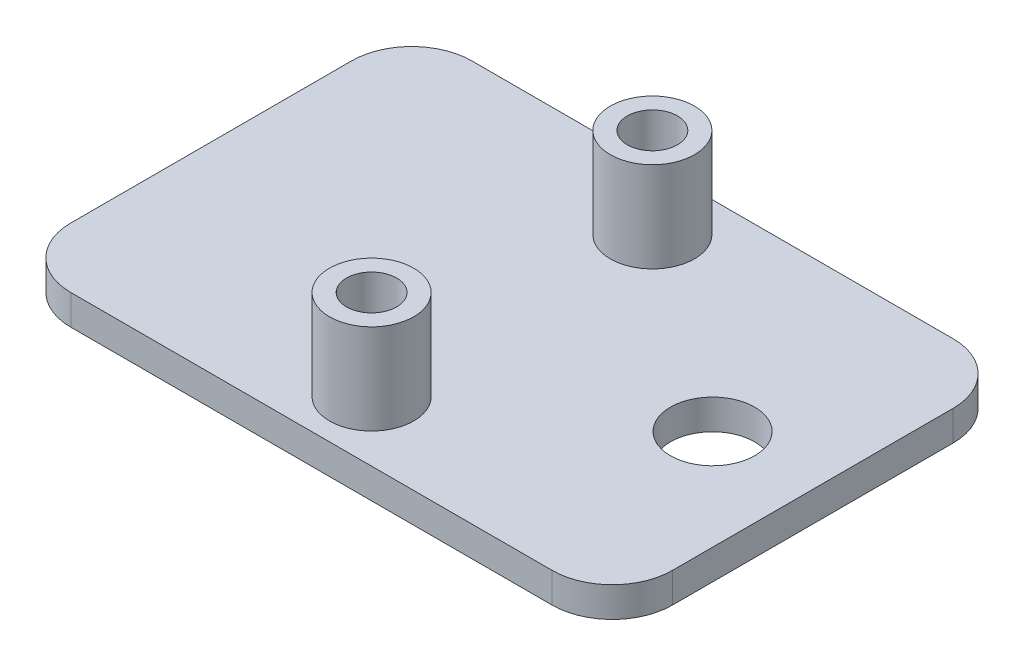
ISO-10303-21;
HEADER;
FILE_DESCRIPTION(('STEP AP214'),'2;1');
FILE_NAME('part.step','',(''),(''),'','','');
FILE_SCHEMA(('AUTOMOTIVE_DESIGN { 1 0 10303 214 1 1 1 1 }'));
ENDSEC;
DATA;
#1=APPLICATION_CONTEXT('core data for automotive mechanical design processes');
#2=APPLICATION_PROTOCOL_DEFINITION('international standard','automotive_design',2000,#1);
#3=PRODUCT_CONTEXT('',#1,'mechanical');
#4=PRODUCT('Part','Part','',(#3));
#5=PRODUCT_RELATED_PRODUCT_CATEGORY('part','',(#4));
#6=PRODUCT_DEFINITION_FORMATION('','',#4);
#7=PRODUCT_DEFINITION_CONTEXT('part definition',#1,'design');
#8=PRODUCT_DEFINITION('design','',#6,#7);
#9=PRODUCT_DEFINITION_SHAPE('','',#8);
#10=(LENGTH_UNIT() NAMED_UNIT(*) SI_UNIT(.MILLI.,.METRE.));
#11=(NAMED_UNIT(*) PLANE_ANGLE_UNIT() SI_UNIT($,.RADIAN.));
#12=(NAMED_UNIT(*) SI_UNIT($,.STERADIAN.) SOLID_ANGLE_UNIT());
#13=UNCERTAINTY_MEASURE_WITH_UNIT(LENGTH_MEASURE(1.E-05),#10,'distance_accuracy_value','');
#14=(GEOMETRIC_REPRESENTATION_CONTEXT(3) GLOBAL_UNCERTAINTY_ASSIGNED_CONTEXT((#13)) GLOBAL_UNIT_ASSIGNED_CONTEXT((#10,
#11,#12)) REPRESENTATION_CONTEXT('',''));
#15=CARTESIAN_POINT('',(0.,0.,0.));
#16=DIRECTION('',(0.,0.,1.));
#17=DIRECTION('',(1.,0.,0.));
#18=AXIS2_PLACEMENT_3D('',#15,#16,#17);
#19=CARTESIAN_POINT('',(-7.384325117692,-1.5,-7.));
#20=DIRECTION('',(0.,1.,0.));
#21=DIRECTION('',(0.,0.,1.));
#22=AXIS2_PLACEMENT_3D('',#19,#20,#21);
#23=CYLINDRICAL_SURFACE('',#22,3.);
#24=CARTESIAN_POINT('',(-7.384325117692,0.,-7.));
#25=DIRECTION('',(0.,1.,0.));
#26=DIRECTION('',(0.,0.,1.));
#27=AXIS2_PLACEMENT_3D('',#24,#25,#26);
#28=CIRCLE('',#27,3.);
#29=CARTESIAN_POINT('',(-7.38432511769198,0.,-10.));
#30=VERTEX_POINT('',#29);
#31=CARTESIAN_POINT('',(-10.384325117692,0.,-6.99999999999998));
#32=VERTEX_POINT('',#31);
#33=EDGE_CURVE('E137',#30,#32,#28,.T.);
#34=ORIENTED_EDGE('',*,*,#33,.F.);
#35=DIRECTION('',(0.,1.,0.));
#36=VECTOR('',#35,1.);
#37=CARTESIAN_POINT('',(-7.38432511769198,-1.5,-10.));
#38=LINE('',#37,#36);
#39=CARTESIAN_POINT('',(-7.38432511769198,-1.5,-10.));
#40=VERTEX_POINT('',#39);
#41=EDGE_CURVE('E11',#40,#30,#38,.T.);
#42=ORIENTED_EDGE('',*,*,#41,.F.);
#43=CARTESIAN_POINT('',(-7.384325117692,-1.5,-7.));
#44=DIRECTION('',(0.,1.,0.));
#45=DIRECTION('',(0.,0.,1.));
#46=AXIS2_PLACEMENT_3D('',#43,#44,#45);
#47=CIRCLE('',#46,3.);
#48=CARTESIAN_POINT('',(-10.384325117692,-1.5,-6.99999999999998));
#49=VERTEX_POINT('',#48);
#50=EDGE_CURVE('E158',#40,#49,#47,.T.);
#51=ORIENTED_EDGE('',*,*,#50,.T.);
#52=DIRECTION('',(0.,1.,0.));
#53=VECTOR('',#52,1.);
#54=CARTESIAN_POINT('',(-10.384325117692,-1.5,-6.99999999999998));
#55=LINE('',#54,#53);
#56=EDGE_CURVE('E43',#49,#32,#55,.T.);
#57=ORIENTED_EDGE('',*,*,#56,.T.);
#58=EDGE_LOOP('',(#34,#42,#51,#57));
#59=FACE_BOUND('',#58,.T.);
#60=ADVANCED_FACE('F40',(#59),#23,.T.);
#61=CARTESIAN_POINT('',(-7.38432511769198,-1.5,-10.));
#62=DIRECTION('',(0.,0.,-1.));
#63=DIRECTION('',(-1.,0.,0.));
#64=AXIS2_PLACEMENT_3D('',#61,#62,#63);
#65=PLANE('',#64);
#66=DIRECTION('',(-1.,0.,0.));
#67=VECTOR('',#66,1.);
#68=CARTESIAN_POINT('',(-7.38432511769198,0.,-10.));
#69=LINE('',#68,#67);
#70=CARTESIAN_POINT('',(16.615674882308,0.,-10.));
#71=VERTEX_POINT('',#70);
#72=EDGE_CURVE('E156',#71,#30,#69,.T.);
#73=ORIENTED_EDGE('',*,*,#72,.F.);
#74=DIRECTION('',(0.,1.,0.));
#75=VECTOR('',#74,1.);
#76=CARTESIAN_POINT('',(16.615674882308,-1.5,-10.));
#77=LINE('',#76,#75);
#78=CARTESIAN_POINT('',(16.615674882308,-1.5,-10.));
#79=VERTEX_POINT('',#78);
#80=EDGE_CURVE('E49',#79,#71,#77,.T.);
#81=ORIENTED_EDGE('',*,*,#80,.F.);
#82=DIRECTION('',(-1.,0.,0.));
#83=VECTOR('',#82,1.);
#84=CARTESIAN_POINT('',(-7.38432511769198,-1.5,-10.));
#85=LINE('',#84,#83);
#86=EDGE_CURVE('E127',#79,#40,#85,.T.);
#87=ORIENTED_EDGE('',*,*,#86,.T.);
#88=ORIENTED_EDGE('',*,*,#41,.T.);
#89=EDGE_LOOP('',(#73,#81,#87,#88));
#90=FACE_BOUND('',#89,.T.);
#91=ADVANCED_FACE('F170',(#90),#65,.T.);
#92=CARTESIAN_POINT('',(16.615674882308,-1.5,-7.));
#93=DIRECTION('',(0.,1.,0.));
#94=DIRECTION('',(0.,0.,1.));
#95=AXIS2_PLACEMENT_3D('',#92,#93,#94);
#96=CYLINDRICAL_SURFACE('',#95,3.);
#97=CARTESIAN_POINT('',(16.615674882308,0.,-7.));
#98=DIRECTION('',(0.,1.,0.));
#99=DIRECTION('',(0.,0.,1.));
#100=AXIS2_PLACEMENT_3D('',#97,#98,#99);
#101=CIRCLE('',#100,3.);
#102=CARTESIAN_POINT('',(19.615674882308,0.,-6.99999999999998));
#103=VERTEX_POINT('',#102);
#104=EDGE_CURVE('E114',#103,#71,#101,.T.);
#105=ORIENTED_EDGE('',*,*,#104,.F.);
#106=DIRECTION('',(0.,1.,0.));
#107=VECTOR('',#106,1.);
#108=CARTESIAN_POINT('',(19.615674882308,-1.5,-6.99999999999998));
#109=LINE('',#108,#107);
#110=CARTESIAN_POINT('',(19.615674882308,-1.5,-6.99999999999998));
#111=VERTEX_POINT('',#110);
#112=EDGE_CURVE('E109',#111,#103,#109,.T.);
#113=ORIENTED_EDGE('',*,*,#112,.F.);
#114=CARTESIAN_POINT('',(16.615674882308,-1.5,-7.));
#115=DIRECTION('',(0.,1.,0.));
#116=DIRECTION('',(0.,0.,1.));
#117=AXIS2_PLACEMENT_3D('',#114,#115,#116);
#118=CIRCLE('',#117,3.);
#119=EDGE_CURVE('E112',#111,#79,#118,.T.);
#120=ORIENTED_EDGE('',*,*,#119,.T.);
#121=ORIENTED_EDGE('',*,*,#80,.T.);
#122=EDGE_LOOP('',(#105,#113,#120,#121));
#123=FACE_BOUND('',#122,.T.);
#124=ADVANCED_FACE('F111',(#123),#96,.T.);
#125=CARTESIAN_POINT('',(19.615674882308,-1.5,-6.99999999999998));
#126=DIRECTION('',(1.,0.,0.));
#127=DIRECTION('',(0.,0.,-1.));
#128=AXIS2_PLACEMENT_3D('',#125,#126,#127);
#129=PLANE('',#128);
#130=DIRECTION('',(0.,0.,-1.));
#131=VECTOR('',#130,1.);
#132=CARTESIAN_POINT('',(19.615674882308,0.,-6.99999999999998));
#133=LINE('',#132,#131);
#134=CARTESIAN_POINT('',(19.615674882308,0.,6.99999999999998));
#135=VERTEX_POINT('',#134);
#136=EDGE_CURVE('E153',#135,#103,#133,.T.);
#137=ORIENTED_EDGE('',*,*,#136,.F.);
#138=DIRECTION('',(0.,1.,0.));
#139=VECTOR('',#138,1.);
#140=CARTESIAN_POINT('',(19.615674882308,-1.5,6.99999999999998));
#141=LINE('',#140,#139);
#142=CARTESIAN_POINT('',(19.615674882308,-1.5,6.99999999999998));
#143=VERTEX_POINT('',#142);
#144=EDGE_CURVE('E119',#143,#135,#141,.T.);
#145=ORIENTED_EDGE('',*,*,#144,.F.);
#146=DIRECTION('',(0.,0.,-1.));
#147=VECTOR('',#146,1.);
#148=CARTESIAN_POINT('',(19.615674882308,-1.5,-6.99999999999998));
#149=LINE('',#148,#147);
#150=EDGE_CURVE('E125',#143,#111,#149,.T.);
#151=ORIENTED_EDGE('',*,*,#150,.T.);
#152=ORIENTED_EDGE('',*,*,#112,.T.);
#153=EDGE_LOOP('',(#137,#145,#151,#152));
#154=FACE_BOUND('',#153,.T.);
#155=ADVANCED_FACE('F129',(#154),#129,.T.);
#156=CARTESIAN_POINT('',(16.615674882308,-1.5,7.));
#157=DIRECTION('',(0.,1.,0.));
#158=DIRECTION('',(0.,0.,1.));
#159=AXIS2_PLACEMENT_3D('',#156,#157,#158);
#160=CYLINDRICAL_SURFACE('',#159,3.);
#161=CARTESIAN_POINT('',(16.615674882308,0.,7.));
#162=DIRECTION('',(0.,1.,0.));
#163=DIRECTION('',(0.,0.,1.));
#164=AXIS2_PLACEMENT_3D('',#161,#162,#163);
#165=CIRCLE('',#164,3.);
#166=CARTESIAN_POINT('',(16.615674882308,0.,10.));
#167=VERTEX_POINT('',#166);
#168=EDGE_CURVE('E150',#167,#135,#165,.T.);
#169=ORIENTED_EDGE('',*,*,#168,.F.);
#170=DIRECTION('',(0.,1.,0.));
#171=VECTOR('',#170,1.);
#172=CARTESIAN_POINT('',(16.615674882308,-1.5,10.));
#173=LINE('',#172,#171);
#174=CARTESIAN_POINT('',(16.615674882308,-1.5,10.));
#175=VERTEX_POINT('',#174);
#176=EDGE_CURVE('E162',#175,#167,#173,.T.);
#177=ORIENTED_EDGE('',*,*,#176,.F.);
#178=CARTESIAN_POINT('',(16.615674882308,-1.5,7.));
#179=DIRECTION('',(0.,1.,0.));
#180=DIRECTION('',(0.,0.,1.));
#181=AXIS2_PLACEMENT_3D('',#178,#179,#180);
#182=CIRCLE('',#181,3.);
#183=EDGE_CURVE('E130',#175,#143,#182,.T.);
#184=ORIENTED_EDGE('',*,*,#183,.T.);
#185=ORIENTED_EDGE('',*,*,#144,.T.);
#186=EDGE_LOOP('',(#169,#177,#184,#185));
#187=FACE_BOUND('',#186,.T.);
#188=ADVANCED_FACE('F183',(#187),#160,.T.);
#189=CARTESIAN_POINT('',(16.615674882308,-1.5,10.));
#190=DIRECTION('',(0.,0.,1.));
#191=DIRECTION('',(1.,0.,0.));
#192=AXIS2_PLACEMENT_3D('',#189,#190,#191);
#193=PLANE('',#192);
#194=DIRECTION('',(1.,0.,0.));
#195=VECTOR('',#194,1.);
#196=CARTESIAN_POINT('',(16.615674882308,0.,10.));
#197=LINE('',#196,#195);
#198=CARTESIAN_POINT('',(-7.38432511769198,0.,10.));
#199=VERTEX_POINT('',#198);
#200=EDGE_CURVE('E147',#199,#167,#197,.T.);
#201=ORIENTED_EDGE('',*,*,#200,.F.);
#202=DIRECTION('',(0.,1.,0.));
#203=VECTOR('',#202,1.);
#204=CARTESIAN_POINT('',(-7.38432511769198,-1.5,10.));
#205=LINE('',#204,#203);
#206=CARTESIAN_POINT('',(-7.38432511769198,-1.5,10.));
#207=VERTEX_POINT('',#206);
#208=EDGE_CURVE('E164',#207,#199,#205,.T.);
#209=ORIENTED_EDGE('',*,*,#208,.F.);
#210=DIRECTION('',(1.,0.,0.));
#211=VECTOR('',#210,1.);
#212=CARTESIAN_POINT('',(16.615674882308,-1.5,10.));
#213=LINE('',#212,#211);
#214=EDGE_CURVE('E132',#207,#175,#213,.T.);
#215=ORIENTED_EDGE('',*,*,#214,.T.);
#216=ORIENTED_EDGE('',*,*,#176,.T.);
#217=EDGE_LOOP('',(#201,#209,#215,#216));
#218=FACE_BOUND('',#217,.T.);
#219=ADVANCED_FACE('F186',(#218),#193,.T.);
#220=CARTESIAN_POINT('',(-7.384325117692,-1.5,7.));
#221=DIRECTION('',(0.,1.,0.));
#222=DIRECTION('',(0.,0.,1.));
#223=AXIS2_PLACEMENT_3D('',#220,#221,#222);
#224=CYLINDRICAL_SURFACE('',#223,3.);
#225=CARTESIAN_POINT('',(-7.384325117692,0.,7.));
#226=DIRECTION('',(0.,1.,0.));
#227=DIRECTION('',(0.,0.,1.));
#228=AXIS2_PLACEMENT_3D('',#225,#226,#227);
#229=CIRCLE('',#228,3.);
#230=CARTESIAN_POINT('',(-10.384325117692,0.,6.99999999999998));
#231=VERTEX_POINT('',#230);
#232=EDGE_CURVE('E144',#231,#199,#229,.T.);
#233=ORIENTED_EDGE('',*,*,#232,.F.);
#234=DIRECTION('',(0.,1.,0.));
#235=VECTOR('',#234,1.);
#236=CARTESIAN_POINT('',(-10.384325117692,-1.5,6.99999999999998));
#237=LINE('',#236,#235);
#238=CARTESIAN_POINT('',(-10.384325117692,-1.5,6.99999999999998));
#239=VERTEX_POINT('',#238);
#240=EDGE_CURVE('E165',#239,#231,#237,.T.);
#241=ORIENTED_EDGE('',*,*,#240,.F.);
#242=CARTESIAN_POINT('',(-7.384325117692,-1.5,7.));
#243=DIRECTION('',(0.,1.,0.));
#244=DIRECTION('',(0.,0.,1.));
#245=AXIS2_PLACEMENT_3D('',#242,#243,#244);
#246=CIRCLE('',#245,3.);
#247=EDGE_CURVE('E277',#239,#207,#246,.T.);
#248=ORIENTED_EDGE('',*,*,#247,.T.);
#249=ORIENTED_EDGE('',*,*,#208,.T.);
#250=EDGE_LOOP('',(#233,#241,#248,#249));
#251=FACE_BOUND('',#250,.T.);
#252=ADVANCED_FACE('F190',(#251),#224,.T.);
#253=CARTESIAN_POINT('',(-10.384325117692,-1.5,6.99999999999998));
#254=DIRECTION('',(-1.,0.,0.));
#255=DIRECTION('',(0.,0.,1.));
#256=AXIS2_PLACEMENT_3D('',#253,#254,#255);
#257=PLANE('',#256);
#258=DIRECTION('',(0.,0.,1.));
#259=VECTOR('',#258,1.);
#260=CARTESIAN_POINT('',(-10.384325117692,0.,6.99999999999998));
#261=LINE('',#260,#259);
#262=EDGE_CURVE('E140',#32,#231,#261,.T.);
#263=ORIENTED_EDGE('',*,*,#262,.F.);
#264=ORIENTED_EDGE('',*,*,#56,.F.);
#265=DIRECTION('',(0.,0.,1.));
#266=VECTOR('',#265,1.);
#267=CARTESIAN_POINT('',(-10.384325117692,-1.5,6.99999999999998));
#268=LINE('',#267,#266);
#269=EDGE_CURVE('E275',#49,#239,#268,.T.);
#270=ORIENTED_EDGE('',*,*,#269,.T.);
#271=ORIENTED_EDGE('',*,*,#240,.T.);
#272=EDGE_LOOP('',(#263,#264,#270,#271));
#273=FACE_BOUND('',#272,.T.);
#274=ADVANCED_FACE('F167',(#273),#257,.T.);
#275=CARTESIAN_POINT('',(-7.384325117692,-1.5,-7.));
#276=DIRECTION('',(0.,1.,0.));
#277=DIRECTION('',(0.,0.,1.));
#278=AXIS2_PLACEMENT_3D('',#275,#276,#277);
#279=PLANE('',#278);
#280=CARTESIAN_POINT('',(14.615674882308,-1.5,0.));
#281=DIRECTION('',(0.,1.,0.));
#282=DIRECTION('',(0.,0.,1.));
#283=AXIS2_PLACEMENT_3D('',#280,#281,#282);
#284=CIRCLE('',#283,2.1);
#285=CARTESIAN_POINT('',(14.615674882308,-1.5,2.1));
#286=VERTEX_POINT('',#285);
#287=EDGE_CURVE('E141',#286,#286,#284,.T.);
#288=ORIENTED_EDGE('',*,*,#287,.T.);
#289=EDGE_LOOP('',(#288));
#290=FACE_BOUND('',#289,.T.);
#291=ORIENTED_EDGE('',*,*,#50,.F.);
#292=ORIENTED_EDGE('',*,*,#86,.F.);
#293=ORIENTED_EDGE('',*,*,#119,.F.);
#294=ORIENTED_EDGE('',*,*,#150,.F.);
#295=ORIENTED_EDGE('',*,*,#183,.F.);
#296=ORIENTED_EDGE('',*,*,#214,.F.);
#297=ORIENTED_EDGE('',*,*,#247,.F.);
#298=ORIENTED_EDGE('',*,*,#269,.F.);
#299=EDGE_LOOP('',(#291,#292,#293,#294,#295,#296,#297,#298));
#300=FACE_BOUND('',#299,.T.);
#301=ADVANCED_FACE('F123',(#290,#300),#279,.F.);
#302=CARTESIAN_POINT('',(-7.384325117692,0.,-7.));
#303=DIRECTION('',(0.,1.,0.));
#304=DIRECTION('',(0.,0.,1.));
#305=AXIS2_PLACEMENT_3D('',#302,#303,#304);
#306=PLANE('',#305);
#307=CARTESIAN_POINT('',(4.615674882308,0.,7.));
#308=DIRECTION('',(0.,1.,0.));
#309=DIRECTION('',(0.,0.,1.));
#310=AXIS2_PLACEMENT_3D('',#307,#308,#309);
#311=CIRCLE('',#310,2.1);
#312=CARTESIAN_POINT('',(4.615674882308,0.,9.1));
#313=VERTEX_POINT('',#312);
#314=EDGE_CURVE('E258',#313,#313,#311,.T.);
#315=ORIENTED_EDGE('',*,*,#314,.F.);
#316=EDGE_LOOP('',(#315));
#317=FACE_BOUND('',#316,.T.);
#318=CARTESIAN_POINT('',(4.615674882308,0.,-7.));
#319=DIRECTION('',(0.,1.,0.));
#320=DIRECTION('',(0.,0.,1.));
#321=AXIS2_PLACEMENT_3D('',#318,#319,#320);
#322=CIRCLE('',#321,2.1);
#323=CARTESIAN_POINT('',(4.615674882308,0.,-4.9));
#324=VERTEX_POINT('',#323);
#325=EDGE_CURVE('E262',#324,#324,#322,.T.);
#326=ORIENTED_EDGE('',*,*,#325,.F.);
#327=EDGE_LOOP('',(#326));
#328=FACE_BOUND('',#327,.T.);
#329=CARTESIAN_POINT('',(14.615674882308,0.,0.));
#330=DIRECTION('',(0.,1.,0.));
#331=DIRECTION('',(0.,0.,1.));
#332=AXIS2_PLACEMENT_3D('',#329,#330,#331);
#333=CIRCLE('',#332,2.1);
#334=CARTESIAN_POINT('',(14.615674882308,0.,2.1));
#335=VERTEX_POINT('',#334);
#336=EDGE_CURVE('E268',#335,#335,#333,.T.);
#337=ORIENTED_EDGE('',*,*,#336,.F.);
#338=EDGE_LOOP('',(#337));
#339=FACE_BOUND('',#338,.T.);
#340=ORIENTED_EDGE('',*,*,#33,.T.);
#341=ORIENTED_EDGE('',*,*,#262,.T.);
#342=ORIENTED_EDGE('',*,*,#232,.T.);
#343=ORIENTED_EDGE('',*,*,#200,.T.);
#344=ORIENTED_EDGE('',*,*,#168,.T.);
#345=ORIENTED_EDGE('',*,*,#136,.T.);
#346=ORIENTED_EDGE('',*,*,#104,.T.);
#347=ORIENTED_EDGE('',*,*,#72,.T.);
#348=EDGE_LOOP('',(#340,#341,#342,#343,#344,#345,#346,#347));
#349=FACE_BOUND('',#348,.T.);
#350=ADVANCED_FACE('F169',(#317,#328,#339,#349),#306,.T.);
#351=CARTESIAN_POINT('',(14.615674882308,-1.5,0.));
#352=DIRECTION('',(0.,1.,0.));
#353=DIRECTION('',(0.,0.,1.));
#354=AXIS2_PLACEMENT_3D('',#351,#352,#353);
#355=CYLINDRICAL_SURFACE('',#354,2.1);
#356=ORIENTED_EDGE('',*,*,#287,.F.);
#357=EDGE_LOOP('',(#356));
#358=FACE_BOUND('',#357,.T.);
#359=ORIENTED_EDGE('',*,*,#336,.T.);
#360=EDGE_LOOP('',(#359));
#361=FACE_BOUND('',#360,.T.);
#362=ADVANCED_FACE('F202',(#358,#361),#355,.F.);
#363=CARTESIAN_POINT('',(4.615674882308,4.5,-7.));
#364=DIRECTION('',(0.,-1.,0.));
#365=DIRECTION('',(0.,0.,-1.));
#366=AXIS2_PLACEMENT_3D('',#363,#364,#365);
#367=CYLINDRICAL_SURFACE('',#366,2.1);
#368=CARTESIAN_POINT('',(4.615674882308,4.5,-7.));
#369=DIRECTION('',(0.,1.,0.));
#370=DIRECTION('',(0.,0.,1.));
#371=AXIS2_PLACEMENT_3D('',#368,#369,#370);
#372=CIRCLE('',#371,2.1);
#373=CARTESIAN_POINT('',(4.615674882308,4.5,-4.9));
#374=VERTEX_POINT('',#373);
#375=EDGE_CURVE('E265',#374,#374,#372,.T.);
#376=ORIENTED_EDGE('',*,*,#375,.F.);
#377=EDGE_LOOP('',(#376));
#378=FACE_BOUND('',#377,.T.);
#379=ORIENTED_EDGE('',*,*,#325,.T.);
#380=EDGE_LOOP('',(#379));
#381=FACE_BOUND('',#380,.T.);
#382=ADVANCED_FACE('F208',(#378,#381),#367,.T.);
#383=CARTESIAN_POINT('',(4.615674882308,4.5,-7.));
#384=DIRECTION('',(0.,1.,0.));
#385=DIRECTION('',(0.,0.,1.));
#386=AXIS2_PLACEMENT_3D('',#383,#384,#385);
#387=PLANE('',#386);
#388=CARTESIAN_POINT('',(4.615674882308,4.5,-7.));
#389=DIRECTION('',(0.,1.,0.));
#390=DIRECTION('',(0.,0.,1.));
#391=AXIS2_PLACEMENT_3D('',#388,#389,#390);
#392=CIRCLE('',#391,1.24999999999999);
#393=CARTESIAN_POINT('',(4.615674882308,4.5,-5.75000000000001));
#394=VERTEX_POINT('',#393);
#395=EDGE_CURVE('E248',#394,#394,#392,.T.);
#396=ORIENTED_EDGE('',*,*,#395,.F.);
#397=EDGE_LOOP('',(#396));
#398=FACE_BOUND('',#397,.T.);
#399=ORIENTED_EDGE('',*,*,#375,.T.);
#400=EDGE_LOOP('',(#399));
#401=FACE_BOUND('',#400,.T.);
#402=ADVANCED_FACE('F212',(#398,#401),#387,.T.);
#403=CARTESIAN_POINT('',(4.615674882308,4.5,7.));
#404=DIRECTION('',(0.,-1.,0.));
#405=DIRECTION('',(0.,0.,-1.));
#406=AXIS2_PLACEMENT_3D('',#403,#404,#405);
#407=CYLINDRICAL_SURFACE('',#406,2.1);
#408=CARTESIAN_POINT('',(4.615674882308,4.5,7.));
#409=DIRECTION('',(0.,1.,0.));
#410=DIRECTION('',(0.,0.,1.));
#411=AXIS2_PLACEMENT_3D('',#408,#409,#410);
#412=CIRCLE('',#411,2.1);
#413=CARTESIAN_POINT('',(4.615674882308,4.5,9.1));
#414=VERTEX_POINT('',#413);
#415=EDGE_CURVE('E259',#414,#414,#412,.T.);
#416=ORIENTED_EDGE('',*,*,#415,.F.);
#417=EDGE_LOOP('',(#416));
#418=FACE_BOUND('',#417,.T.);
#419=ORIENTED_EDGE('',*,*,#314,.T.);
#420=EDGE_LOOP('',(#419));
#421=FACE_BOUND('',#420,.T.);
#422=ADVANCED_FACE('F216',(#418,#421),#407,.T.);
#423=CARTESIAN_POINT('',(4.615674882308,4.5,7.));
#424=DIRECTION('',(0.,1.,0.));
#425=DIRECTION('',(0.,0.,1.));
#426=AXIS2_PLACEMENT_3D('',#423,#424,#425);
#427=PLANE('',#426);
#428=CARTESIAN_POINT('',(4.615674882308,4.5,7.));
#429=DIRECTION('',(0.,1.,0.));
#430=DIRECTION('',(0.,0.,1.));
#431=AXIS2_PLACEMENT_3D('',#428,#429,#430);
#432=CIRCLE('',#431,1.24999999999999);
#433=CARTESIAN_POINT('',(4.615674882308,4.5,8.24999999999999));
#434=VERTEX_POINT('',#433);
#435=EDGE_CURVE('E250',#434,#434,#432,.T.);
#436=ORIENTED_EDGE('',*,*,#435,.F.);
#437=EDGE_LOOP('',(#436));
#438=FACE_BOUND('',#437,.T.);
#439=ORIENTED_EDGE('',*,*,#415,.T.);
#440=EDGE_LOOP('',(#439));
#441=FACE_BOUND('',#440,.T.);
#442=ADVANCED_FACE('F220',(#438,#441),#427,.T.);
#443=CARTESIAN_POINT('',(4.615674882308,0.5,7.));
#444=DIRECTION('',(0.,-1.,0.));
#445=DIRECTION('',(0.,0.,-1.));
#446=AXIS2_PLACEMENT_3D('',#443,#444,#445);
#447=PLANE('',#446);
#448=CARTESIAN_POINT('',(4.615674882308,0.5,7.));
#449=DIRECTION('',(0.,1.,0.));
#450=DIRECTION('',(0.,0.,1.));
#451=AXIS2_PLACEMENT_3D('',#448,#449,#450);
#452=CIRCLE('',#451,1.25);
#453=CARTESIAN_POINT('',(4.615674882308,0.5,8.25));
#454=VERTEX_POINT('',#453);
#455=EDGE_CURVE('E255',#454,#454,#452,.T.);
#456=ORIENTED_EDGE('',*,*,#455,.T.);
#457=EDGE_LOOP('',(#456));
#458=FACE_BOUND('',#457,.T.);
#459=ADVANCED_FACE('F224',(#458),#447,.F.);
#460=CARTESIAN_POINT('',(4.615674882308,4.5,7.));
#461=DIRECTION('',(0.,1.,0.));
#462=DIRECTION('',(0.,0.,1.));
#463=AXIS2_PLACEMENT_3D('',#460,#461,#462);
#464=CYLINDRICAL_SURFACE('',#463,1.24999999999999);
#465=ORIENTED_EDGE('',*,*,#455,.F.);
#466=EDGE_LOOP('',(#465));
#467=FACE_BOUND('',#466,.T.);
#468=ORIENTED_EDGE('',*,*,#435,.T.);
#469=EDGE_LOOP('',(#468));
#470=FACE_BOUND('',#469,.T.);
#471=ADVANCED_FACE('F228',(#467,#470),#464,.F.);
#472=CARTESIAN_POINT('',(4.615674882308,0.5,-7.));
#473=DIRECTION('',(0.,-1.,0.));
#474=DIRECTION('',(0.,0.,-1.));
#475=AXIS2_PLACEMENT_3D('',#472,#473,#474);
#476=PLANE('',#475);
#477=CARTESIAN_POINT('',(4.615674882308,0.5,-7.));
#478=DIRECTION('',(0.,1.,0.));
#479=DIRECTION('',(0.,0.,1.));
#480=AXIS2_PLACEMENT_3D('',#477,#478,#479);
#481=CIRCLE('',#480,1.25);
#482=CARTESIAN_POINT('',(4.615674882308,0.5,-5.75));
#483=VERTEX_POINT('',#482);
#484=EDGE_CURVE('E245',#483,#483,#481,.T.);
#485=ORIENTED_EDGE('',*,*,#484,.T.);
#486=EDGE_LOOP('',(#485));
#487=FACE_BOUND('',#486,.T.);
#488=ADVANCED_FACE('F232',(#487),#476,.F.);
#489=CARTESIAN_POINT('',(4.615674882308,4.5,-7.));
#490=DIRECTION('',(0.,1.,0.));
#491=DIRECTION('',(0.,0.,1.));
#492=AXIS2_PLACEMENT_3D('',#489,#490,#491);
#493=CYLINDRICAL_SURFACE('',#492,1.24999999999999);
#494=ORIENTED_EDGE('',*,*,#484,.F.);
#495=EDGE_LOOP('',(#494));
#496=FACE_BOUND('',#495,.T.);
#497=ORIENTED_EDGE('',*,*,#395,.T.);
#498=EDGE_LOOP('',(#497));
#499=FACE_BOUND('',#498,.T.);
#500=ADVANCED_FACE('F236',(#496,#499),#493,.F.);
#501=CLOSED_SHELL('',(#60,#91,#124,#155,#188,#219,#252,#274,#301,#350,#362,#382,#402,#422,#442,
#459,#471,#488,#500));
#502=MANIFOLD_SOLID_BREP('B2',#501);
#503=ADVANCED_BREP_SHAPE_REPRESENTATION('',(#18,#502),#14);
#504=SHAPE_DEFINITION_REPRESENTATION(#9,#503);
ENDSEC;
END-ISO-10303-21;
